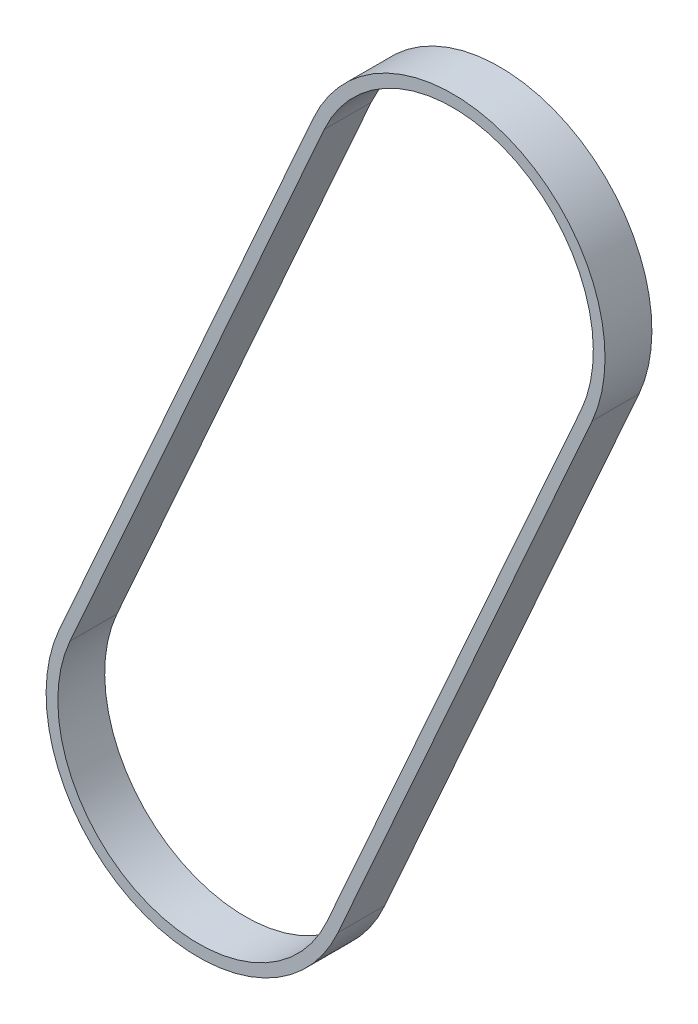
ISO-10303-21;
HEADER;
FILE_DESCRIPTION(('STEP AP214'),'2;1');
FILE_NAME('part.step','',(''),(''),'','','');
FILE_SCHEMA(('AUTOMOTIVE_DESIGN { 1 0 10303 214 1 1 1 1 }'));
ENDSEC;
DATA;
#1=APPLICATION_CONTEXT('core data for automotive mechanical design processes');
#2=APPLICATION_PROTOCOL_DEFINITION('international standard','automotive_design',2000,#1);
#3=PRODUCT_CONTEXT('',#1,'mechanical');
#4=PRODUCT('Part','Part','',(#3));
#5=PRODUCT_RELATED_PRODUCT_CATEGORY('part','',(#4));
#6=PRODUCT_DEFINITION_FORMATION('','',#4);
#7=PRODUCT_DEFINITION_CONTEXT('part definition',#1,'design');
#8=PRODUCT_DEFINITION('design','',#6,#7);
#9=PRODUCT_DEFINITION_SHAPE('','',#8);
#10=(LENGTH_UNIT() NAMED_UNIT(*) SI_UNIT(.MILLI.,.METRE.));
#11=(NAMED_UNIT(*) PLANE_ANGLE_UNIT() SI_UNIT($,.RADIAN.));
#12=(NAMED_UNIT(*) SI_UNIT($,.STERADIAN.) SOLID_ANGLE_UNIT());
#13=UNCERTAINTY_MEASURE_WITH_UNIT(LENGTH_MEASURE(1.E-05),#10,'distance_accuracy_value','');
#14=(GEOMETRIC_REPRESENTATION_CONTEXT(3) GLOBAL_UNCERTAINTY_ASSIGNED_CONTEXT((#13)) GLOBAL_UNIT_ASSIGNED_CONTEXT((#10,
#11,#12)) REPRESENTATION_CONTEXT('',''));
#15=CARTESIAN_POINT('',(0.,0.,0.));
#16=DIRECTION('',(0.,0.,1.));
#17=DIRECTION('',(1.,0.,0.));
#18=AXIS2_PLACEMENT_3D('',#15,#16,#17);
#19=CARTESIAN_POINT('',(0.,0.,10.));
#20=DIRECTION('',(0.,0.,-1.));
#21=DIRECTION('',(-1.,0.,0.));
#22=AXIS2_PLACEMENT_3D('',#19,#20,#21);
#23=CYLINDRICAL_SURFACE('',#22,32.5);
#24=CARTESIAN_POINT('',(0.,0.,0.));
#25=DIRECTION('',(0.,0.,1.));
#26=DIRECTION('',(1.,0.,0.));
#27=AXIS2_PLACEMENT_3D('',#24,#25,#26);
#28=CIRCLE('',#27,32.5);
#29=CARTESIAN_POINT('',(-29.7518809796659,13.0795863150098,0.));
#30=VERTEX_POINT('',#29);
#31=CARTESIAN_POINT('',(29.7518809796659,-13.0795863150098,0.));
#32=VERTEX_POINT('',#31);
#33=EDGE_CURVE('E158',#30,#32,#28,.T.);
#34=ORIENTED_EDGE('',*,*,#33,.T.);
#35=DIRECTION('',(0.,0.,-1.));
#36=VECTOR('',#35,1.);
#37=CARTESIAN_POINT('',(29.7518809796659,-13.0795863150098,10.));
#38=LINE('',#37,#36);
#39=CARTESIAN_POINT('',(29.7518809796659,-13.0795863150098,10.));
#40=VERTEX_POINT('',#39);
#41=EDGE_CURVE('E11',#40,#32,#38,.T.);
#42=ORIENTED_EDGE('',*,*,#41,.F.);
#43=CARTESIAN_POINT('',(0.,0.,10.));
#44=DIRECTION('',(0.,0.,1.));
#45=DIRECTION('',(1.,0.,0.));
#46=AXIS2_PLACEMENT_3D('',#43,#44,#45);
#47=CIRCLE('',#46,32.5);
#48=CARTESIAN_POINT('',(-29.7518809796659,13.0795863150098,10.));
#49=VERTEX_POINT('',#48);
#50=EDGE_CURVE('E131',#49,#40,#47,.T.);
#51=ORIENTED_EDGE('',*,*,#50,.F.);
#52=DIRECTION('',(0.,0.,-1.));
#53=VECTOR('',#52,1.);
#54=CARTESIAN_POINT('',(-29.7518809796659,13.0795863150098,10.));
#55=LINE('',#54,#53);
#56=EDGE_CURVE('E168',#49,#30,#55,.T.);
#57=ORIENTED_EDGE('',*,*,#56,.T.);
#58=EDGE_LOOP('',(#34,#42,#51,#57));
#59=FACE_BOUND('',#58,.T.);
#60=ADVANCED_FACE('F39',(#59),#23,.T.);
#61=CARTESIAN_POINT('',(29.6827218454467,-13.2346961356704,10.));
#62=DIRECTION('',(0.913326988094438,-0.40722697948238,0.));
#63=DIRECTION('',(0.40722697948238,0.913326988094438,0.));
#64=AXIS2_PLACEMENT_3D('',#61,#62,#63);
#65=PLANE('',#64);
#66=DIRECTION('',(-0.40722697948238,-0.913326988094438,0.));
#67=VECTOR('',#66,1.);
#68=CARTESIAN_POINT('',(29.6827218454467,-13.2346961356704,0.));
#69=LINE('',#68,#67);
#70=CARTESIAN_POINT('',(83.9995027895451,108.586755885303,0.));
#71=VERTEX_POINT('',#70);
#72=EDGE_CURVE('E121',#71,#32,#69,.T.);
#73=ORIENTED_EDGE('',*,*,#72,.F.);
#74=DIRECTION('',(0.,0.,-1.));
#75=VECTOR('',#74,1.);
#76=CARTESIAN_POINT('',(83.9995027895451,108.586755885303,10.));
#77=LINE('',#76,#75);
#78=CARTESIAN_POINT('',(83.9995027895451,108.586755885303,10.));
#79=VERTEX_POINT('',#78);
#80=EDGE_CURVE('E50',#79,#71,#77,.T.);
#81=ORIENTED_EDGE('',*,*,#80,.F.);
#82=DIRECTION('',(-0.40722697948238,-0.913326988094438,0.));
#83=VECTOR('',#82,1.);
#84=CARTESIAN_POINT('',(29.6827218454467,-13.2346961356704,10.));
#85=LINE('',#84,#83);
#86=EDGE_CURVE('E119',#79,#40,#85,.T.);
#87=ORIENTED_EDGE('',*,*,#86,.T.);
#88=ORIENTED_EDGE('',*,*,#41,.T.);
#89=EDGE_LOOP('',(#73,#81,#87,#88));
#90=FACE_BOUND('',#89,.T.);
#91=ADVANCED_FACE('F117',(#90),#65,.T.);
#92=CARTESIAN_POINT('',(54.2476218098792,121.666342200313,10.));
#93=DIRECTION('',(0.,0.,-1.));
#94=DIRECTION('',(-1.,0.,0.));
#95=AXIS2_PLACEMENT_3D('',#92,#93,#94);
#96=CYLINDRICAL_SURFACE('',#95,32.5);
#97=CARTESIAN_POINT('',(54.2476218098792,121.666342200313,0.));
#98=DIRECTION('',(0.,0.,1.));
#99=DIRECTION('',(1.,0.,0.));
#100=AXIS2_PLACEMENT_3D('',#97,#98,#99);
#101=CIRCLE('',#100,32.5);
#102=CARTESIAN_POINT('',(24.4957408302132,134.745928515323,0.));
#103=VERTEX_POINT('',#102);
#104=EDGE_CURVE('E86',#71,#103,#101,.T.);
#105=ORIENTED_EDGE('',*,*,#104,.T.);
#106=DIRECTION('',(0.,0.,-1.));
#107=VECTOR('',#106,1.);
#108=CARTESIAN_POINT('',(24.4957408302132,134.745928515323,10.));
#109=LINE('',#108,#107);
#110=CARTESIAN_POINT('',(24.4957408302132,134.745928515323,10.));
#111=VERTEX_POINT('',#110);
#112=EDGE_CURVE('E123',#111,#103,#109,.T.);
#113=ORIENTED_EDGE('',*,*,#112,.F.);
#114=CARTESIAN_POINT('',(54.2476218098792,121.666342200313,10.));
#115=DIRECTION('',(0.,0.,1.));
#116=DIRECTION('',(1.,0.,0.));
#117=AXIS2_PLACEMENT_3D('',#114,#115,#116);
#118=CIRCLE('',#117,32.5);
#119=EDGE_CURVE('E125',#79,#111,#118,.T.);
#120=ORIENTED_EDGE('',*,*,#119,.F.);
#121=ORIENTED_EDGE('',*,*,#80,.T.);
#122=EDGE_LOOP('',(#105,#113,#120,#121));
#123=FACE_BOUND('',#122,.T.);
#124=ADVANCED_FACE('F126',(#123),#96,.T.);
#125=CARTESIAN_POINT('',(27.3998096428331,-12.2168093844714,10.));
#126=DIRECTION('',(0.913326988094438,-0.40722697948238,0.));
#127=DIRECTION('',(0.40722697948238,0.913326988094438,0.));
#128=AXIS2_PLACEMENT_3D('',#125,#126,#127);
#129=PLANE('',#128);
#130=DIRECTION('',(-0.40722697948238,-0.913326988094438,0.));
#131=VECTOR('',#130,1.);
#132=CARTESIAN_POINT('',(27.3998096428331,-12.2168093844714,0.));
#133=LINE('',#132,#131);
#134=CARTESIAN_POINT('',(81.6474314527123,109.449532815842,0.));
#135=VERTEX_POINT('',#134);
#136=CARTESIAN_POINT('',(27.3998096428331,-12.2168093844714,0.));
#137=VERTEX_POINT('',#136);
#138=EDGE_CURVE('E143',#135,#137,#133,.T.);
#139=ORIENTED_EDGE('',*,*,#138,.T.);
#140=DIRECTION('',(0.,0.,-1.));
#141=VECTOR('',#140,1.);
#142=CARTESIAN_POINT('',(27.3998096428331,-12.2168093844714,10.));
#143=LINE('',#142,#141);
#144=CARTESIAN_POINT('',(27.3998096428331,-12.2168093844714,10.));
#145=VERTEX_POINT('',#144);
#146=EDGE_CURVE('E43',#145,#137,#143,.T.);
#147=ORIENTED_EDGE('',*,*,#146,.F.);
#148=DIRECTION('',(-0.40722697948238,-0.913326988094438,0.));
#149=VECTOR('',#148,1.);
#150=CARTESIAN_POINT('',(27.3998096428331,-12.2168093844714,10.));
#151=LINE('',#150,#149);
#152=CARTESIAN_POINT('',(81.6474314527123,109.449532815842,10.));
#153=VERTEX_POINT('',#152);
#154=EDGE_CURVE('E101',#153,#145,#151,.T.);
#155=ORIENTED_EDGE('',*,*,#154,.F.);
#156=DIRECTION('',(0.,0.,-1.));
#157=VECTOR('',#156,1.);
#158=CARTESIAN_POINT('',(81.6474314527123,109.449532815842,10.));
#159=LINE('',#158,#157);
#160=EDGE_CURVE('E142',#153,#135,#159,.T.);
#161=ORIENTED_EDGE('',*,*,#160,.T.);
#162=EDGE_LOOP('',(#139,#147,#155,#161));
#163=FACE_BOUND('',#162,.T.);
#164=ADVANCED_FACE('F41',(#163),#129,.F.);
#165=CARTESIAN_POINT('',(0.,0.,10.));
#166=DIRECTION('',(0.,0.,-1.));
#167=DIRECTION('',(-1.,0.,0.));
#168=AXIS2_PLACEMENT_3D('',#165,#166,#167);
#169=CYLINDRICAL_SURFACE('',#168,30.);
#170=CARTESIAN_POINT('',(0.,0.,0.));
#171=DIRECTION('',(0.,0.,1.));
#172=DIRECTION('',(1.,0.,0.));
#173=AXIS2_PLACEMENT_3D('',#170,#171,#172);
#174=CIRCLE('',#173,30.);
#175=CARTESIAN_POINT('',(-27.3998096428331,12.2168093844714,0.));
#176=VERTEX_POINT('',#175);
#177=EDGE_CURVE('E147',#176,#137,#174,.T.);
#178=ORIENTED_EDGE('',*,*,#177,.F.);
#179=DIRECTION('',(0.,0.,-1.));
#180=VECTOR('',#179,1.);
#181=CARTESIAN_POINT('',(-27.3998096428331,12.2168093844714,10.));
#182=LINE('',#181,#180);
#183=CARTESIAN_POINT('',(-27.3998096428331,12.2168093844714,10.));
#184=VERTEX_POINT('',#183);
#185=EDGE_CURVE('E178',#184,#176,#182,.T.);
#186=ORIENTED_EDGE('',*,*,#185,.F.);
#187=CARTESIAN_POINT('',(0.,0.,10.));
#188=DIRECTION('',(0.,0.,1.));
#189=DIRECTION('',(1.,0.,0.));
#190=AXIS2_PLACEMENT_3D('',#187,#188,#189);
#191=CIRCLE('',#190,30.);
#192=EDGE_CURVE('E188',#184,#145,#191,.T.);
#193=ORIENTED_EDGE('',*,*,#192,.T.);
#194=ORIENTED_EDGE('',*,*,#146,.T.);
#195=EDGE_LOOP('',(#178,#186,#193,#194));
#196=FACE_BOUND('',#195,.T.);
#197=ADVANCED_FACE('F187',(#196),#169,.F.);
#198=CARTESIAN_POINT('',(-27.3998096428331,12.2168093844714,10.));
#199=DIRECTION('',(0.913326988094438,-0.40722697948238,0.));
#200=DIRECTION('',(0.40722697948238,0.913326988094438,0.));
#201=AXIS2_PLACEMENT_3D('',#198,#199,#200);
#202=PLANE('',#201);
#203=DIRECTION('',(-0.40722697948238,-0.913326988094438,0.));
#204=VECTOR('',#203,1.);
#205=CARTESIAN_POINT('',(-27.3998096428331,12.2168093844714,0.));
#206=LINE('',#205,#204);
#207=CARTESIAN_POINT('',(26.847812167046,133.883151584784,0.));
#208=VERTEX_POINT('',#207);
#209=EDGE_CURVE('E151',#208,#176,#206,.T.);
#210=ORIENTED_EDGE('',*,*,#209,.F.);
#211=DIRECTION('',(0.,0.,-1.));
#212=VECTOR('',#211,1.);
#213=CARTESIAN_POINT('',(26.847812167046,133.883151584784,10.));
#214=LINE('',#213,#212);
#215=CARTESIAN_POINT('',(26.847812167046,133.883151584784,10.));
#216=VERTEX_POINT('',#215);
#217=EDGE_CURVE('E176',#216,#208,#214,.T.);
#218=ORIENTED_EDGE('',*,*,#217,.F.);
#219=DIRECTION('',(-0.40722697948238,-0.913326988094438,0.));
#220=VECTOR('',#219,1.);
#221=CARTESIAN_POINT('',(-27.3998096428331,12.2168093844714,10.));
#222=LINE('',#221,#220);
#223=EDGE_CURVE('E199',#216,#184,#222,.T.);
#224=ORIENTED_EDGE('',*,*,#223,.T.);
#225=ORIENTED_EDGE('',*,*,#185,.T.);
#226=EDGE_LOOP('',(#210,#218,#224,#225));
#227=FACE_BOUND('',#226,.T.);
#228=ADVANCED_FACE('F196',(#227),#202,.T.);
#229=CARTESIAN_POINT('',(54.2476218098792,121.666342200313,10.));
#230=DIRECTION('',(0.,0.,-1.));
#231=DIRECTION('',(-1.,0.,0.));
#232=AXIS2_PLACEMENT_3D('',#229,#230,#231);
#233=CYLINDRICAL_SURFACE('',#232,30.);
#234=CARTESIAN_POINT('',(54.2476218098792,121.666342200313,0.));
#235=DIRECTION('',(0.,0.,1.));
#236=DIRECTION('',(1.,0.,0.));
#237=AXIS2_PLACEMENT_3D('',#234,#235,#236);
#238=CIRCLE('',#237,30.);
#239=EDGE_CURVE('E155',#208,#135,#238,.F.);
#240=ORIENTED_EDGE('',*,*,#239,.T.);
#241=ORIENTED_EDGE('',*,*,#160,.F.);
#242=CARTESIAN_POINT('',(54.2476218098792,121.666342200313,10.));
#243=DIRECTION('',(0.,0.,1.));
#244=DIRECTION('',(1.,0.,0.));
#245=AXIS2_PLACEMENT_3D('',#242,#243,#244);
#246=CIRCLE('',#245,30.);
#247=EDGE_CURVE('E136',#216,#153,#246,.F.);
#248=ORIENTED_EDGE('',*,*,#247,.F.);
#249=ORIENTED_EDGE('',*,*,#217,.T.);
#250=EDGE_LOOP('',(#240,#241,#248,#249));
#251=FACE_BOUND('',#250,.T.);
#252=ADVANCED_FACE('F201',(#251),#233,.F.);
#253=CARTESIAN_POINT('',(-29.6827218454467,13.2346961356704,10.));
#254=DIRECTION('',(0.913326988094438,-0.40722697948238,0.));
#255=DIRECTION('',(0.40722697948238,0.913326988094438,0.));
#256=AXIS2_PLACEMENT_3D('',#253,#254,#255);
#257=PLANE('',#256);
#258=DIRECTION('',(-0.40722697948238,-0.913326988094438,0.));
#259=VECTOR('',#258,1.);
#260=CARTESIAN_POINT('',(-29.6827218454467,13.2346961356704,0.));
#261=LINE('',#260,#259);
#262=EDGE_CURVE('E92',#103,#30,#261,.T.);
#263=ORIENTED_EDGE('',*,*,#262,.T.);
#264=ORIENTED_EDGE('',*,*,#56,.F.);
#265=DIRECTION('',(-0.40722697948238,-0.913326988094438,0.));
#266=VECTOR('',#265,1.);
#267=CARTESIAN_POINT('',(-29.6827218454467,13.2346961356704,10.));
#268=LINE('',#267,#266);
#269=EDGE_CURVE('E59',#111,#49,#268,.T.);
#270=ORIENTED_EDGE('',*,*,#269,.F.);
#271=ORIENTED_EDGE('',*,*,#112,.T.);
#272=EDGE_LOOP('',(#263,#264,#270,#271));
#273=FACE_BOUND('',#272,.T.);
#274=ADVANCED_FACE('F210',(#273),#257,.F.);
#275=CARTESIAN_POINT('',(0.,0.,10.));
#276=DIRECTION('',(0.,0.,1.));
#277=DIRECTION('',(1.,0.,0.));
#278=AXIS2_PLACEMENT_3D('',#275,#276,#277);
#279=PLANE('',#278);
#280=ORIENTED_EDGE('',*,*,#154,.T.);
#281=ORIENTED_EDGE('',*,*,#192,.F.);
#282=ORIENTED_EDGE('',*,*,#223,.F.);
#283=ORIENTED_EDGE('',*,*,#247,.T.);
#284=EDGE_LOOP('',(#280,#281,#282,#283));
#285=FACE_BOUND('',#284,.T.);
#286=ORIENTED_EDGE('',*,*,#50,.T.);
#287=ORIENTED_EDGE('',*,*,#86,.F.);
#288=ORIENTED_EDGE('',*,*,#119,.T.);
#289=ORIENTED_EDGE('',*,*,#269,.T.);
#290=EDGE_LOOP('',(#286,#287,#288,#289));
#291=FACE_BOUND('',#290,.T.);
#292=ADVANCED_FACE('F129',(#285,#291),#279,.T.);
#293=CARTESIAN_POINT('',(0.,0.,0.));
#294=DIRECTION('',(0.,0.,1.));
#295=DIRECTION('',(1.,0.,0.));
#296=AXIS2_PLACEMENT_3D('',#293,#294,#295);
#297=PLANE('',#296);
#298=ORIENTED_EDGE('',*,*,#138,.F.);
#299=ORIENTED_EDGE('',*,*,#239,.F.);
#300=ORIENTED_EDGE('',*,*,#209,.T.);
#301=ORIENTED_EDGE('',*,*,#177,.T.);
#302=EDGE_LOOP('',(#298,#299,#300,#301));
#303=FACE_BOUND('',#302,.T.);
#304=ORIENTED_EDGE('',*,*,#33,.F.);
#305=ORIENTED_EDGE('',*,*,#262,.F.);
#306=ORIENTED_EDGE('',*,*,#104,.F.);
#307=ORIENTED_EDGE('',*,*,#72,.T.);
#308=EDGE_LOOP('',(#304,#305,#306,#307));
#309=FACE_BOUND('',#308,.T.);
#310=ADVANCED_FACE('F194',(#303,#309),#297,.F.);
#311=CLOSED_SHELL('',(#60,#91,#124,#164,#197,#228,#252,#274,#292,#310));
#312=MANIFOLD_SOLID_BREP('B2',#311);
#313=ADVANCED_BREP_SHAPE_REPRESENTATION('',(#18,#312),#14);
#314=SHAPE_DEFINITION_REPRESENTATION(#9,#313);
ENDSEC;
END-ISO-10303-21;
